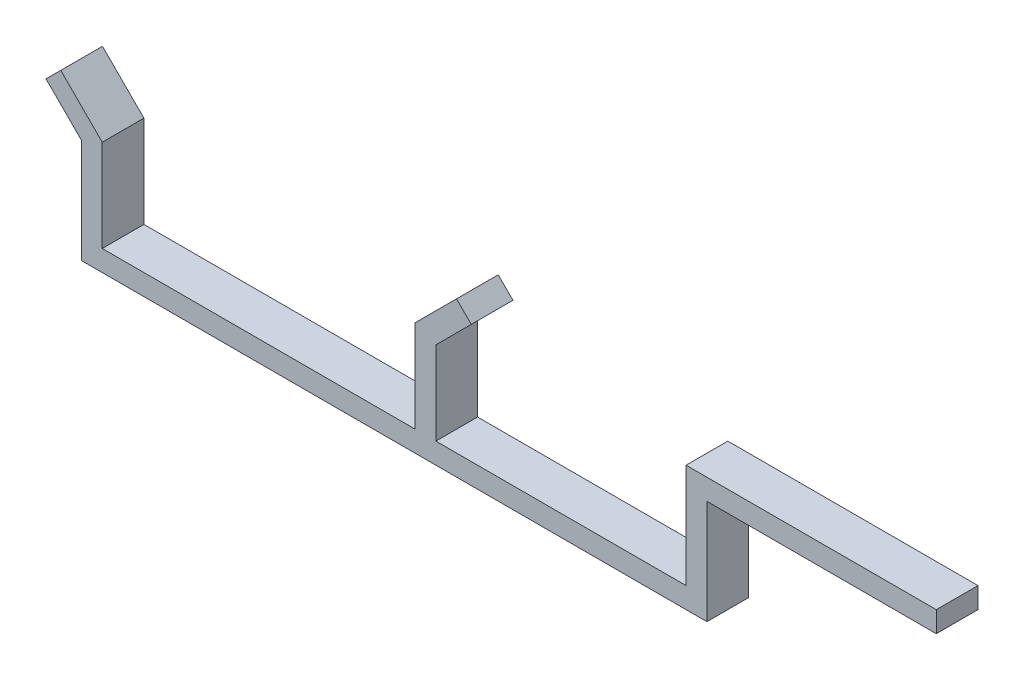
ISO-10303-21;
HEADER;
FILE_DESCRIPTION(('STEP AP214'),'2;1');
FILE_NAME('part.step','',(''),(''),'','','');
FILE_SCHEMA(('AUTOMOTIVE_DESIGN { 1 0 10303 214 1 1 1 1 }'));
ENDSEC;
DATA;
#1=APPLICATION_CONTEXT('core data for automotive mechanical design processes');
#2=APPLICATION_PROTOCOL_DEFINITION('international standard','automotive_design',2000,#1);
#3=PRODUCT_CONTEXT('',#1,'mechanical');
#4=PRODUCT('Part','Part','',(#3));
#5=PRODUCT_RELATED_PRODUCT_CATEGORY('part','',(#4));
#6=PRODUCT_DEFINITION_FORMATION('','',#4);
#7=PRODUCT_DEFINITION_CONTEXT('part definition',#1,'design');
#8=PRODUCT_DEFINITION('design','',#6,#7);
#9=PRODUCT_DEFINITION_SHAPE('','',#8);
#10=(LENGTH_UNIT() NAMED_UNIT(*) SI_UNIT(.MILLI.,.METRE.));
#11=(NAMED_UNIT(*) PLANE_ANGLE_UNIT() SI_UNIT($,.RADIAN.));
#12=(NAMED_UNIT(*) SI_UNIT($,.STERADIAN.) SOLID_ANGLE_UNIT());
#13=UNCERTAINTY_MEASURE_WITH_UNIT(LENGTH_MEASURE(1.E-05),#10,'distance_accuracy_value','');
#14=(GEOMETRIC_REPRESENTATION_CONTEXT(3) GLOBAL_UNCERTAINTY_ASSIGNED_CONTEXT((#13)) GLOBAL_UNIT_ASSIGNED_CONTEXT((#10,
#11,#12)) REPRESENTATION_CONTEXT('',''));
#15=CARTESIAN_POINT('',(0.,0.,0.));
#16=DIRECTION('',(0.,0.,1.));
#17=DIRECTION('',(1.,0.,0.));
#18=AXIS2_PLACEMENT_3D('',#15,#16,#17);
#19=CARTESIAN_POINT('',(-42.5000000000001,8.63523936170218,10.));
#20=DIRECTION('',(0.707106781186547,0.707106781186548,0.));
#21=DIRECTION('',(-0.707106781186548,0.707106781186547,0.));
#22=AXIS2_PLACEMENT_3D('',#19,#20,#21);
#23=PLANE('',#22);
#24=DIRECTION('',(0.707106781186548,-0.707106781186547,0.));
#25=VECTOR('',#24,1.);
#26=CARTESIAN_POINT('',(-42.5,8.63523936170218,0.));
#27=LINE('',#26,#25);
#28=CARTESIAN_POINT('',(-50.9852813742386,17.1205207359407,0.));
#29=VERTEX_POINT('',#28);
#30=CARTESIAN_POINT('',(-42.5,8.63523936170218,0.));
#31=VERTEX_POINT('',#30);
#32=EDGE_CURVE('E197',#29,#31,#27,.T.);
#33=ORIENTED_EDGE('',*,*,#32,.T.);
#34=DIRECTION('',(0.,0.,-1.));
#35=VECTOR('',#34,1.);
#36=CARTESIAN_POINT('',(-42.5000000000001,8.63523936170218,10.));
#37=LINE('',#36,#35);
#38=CARTESIAN_POINT('',(-42.5000000000001,8.63523936170218,10.));
#39=VERTEX_POINT('',#38);
#40=EDGE_CURVE('E11',#39,#31,#37,.T.);
#41=ORIENTED_EDGE('',*,*,#40,.F.);
#42=DIRECTION('',(0.707106781186548,-0.707106781186547,0.));
#43=VECTOR('',#42,1.);
#44=CARTESIAN_POINT('',(-42.5000000000001,8.63523936170218,10.));
#45=LINE('',#44,#43);
#46=CARTESIAN_POINT('',(-50.9852813742387,17.1205207359407,10.));
#47=VERTEX_POINT('',#46);
#48=EDGE_CURVE('E251',#47,#39,#45,.T.);
#49=ORIENTED_EDGE('',*,*,#48,.F.);
#50=DIRECTION('',(0.,0.,-1.));
#51=VECTOR('',#50,1.);
#52=CARTESIAN_POINT('',(-50.9852813742387,17.1205207359407,10.));
#53=LINE('',#52,#51);
#54=EDGE_CURVE('E193',#47,#29,#53,.T.);
#55=ORIENTED_EDGE('',*,*,#54,.T.);
#56=EDGE_LOOP('',(#33,#41,#49,#55));
#57=FACE_BOUND('',#56,.T.);
#58=ADVANCED_FACE('F36',(#57),#23,.F.);
#59=CARTESIAN_POINT('',(-42.5000000000001,8.63523936170218,10.));
#60=DIRECTION('',(1.,0.,0.));
#61=DIRECTION('',(0.,1.,0.));
#62=AXIS2_PLACEMENT_3D('',#59,#60,#61);
#63=PLANE('',#62);
#64=DIRECTION('',(0.,-1.,0.));
#65=VECTOR('',#64,1.);
#66=CARTESIAN_POINT('',(-42.5,8.63523936170218,0.));
#67=LINE('',#66,#65);
#68=CARTESIAN_POINT('',(-42.5,-16.3647606382978,0.));
#69=VERTEX_POINT('',#68);
#70=EDGE_CURVE('E201',#31,#69,#67,.T.);
#71=ORIENTED_EDGE('',*,*,#70,.T.);
#72=DIRECTION('',(0.,0.,-1.));
#73=VECTOR('',#72,1.);
#74=CARTESIAN_POINT('',(-42.5000000000001,-16.3647606382978,10.));
#75=LINE('',#74,#73);
#76=CARTESIAN_POINT('',(-42.5000000000001,-16.3647606382978,10.));
#77=VERTEX_POINT('',#76);
#78=EDGE_CURVE('E45',#77,#69,#75,.T.);
#79=ORIENTED_EDGE('',*,*,#78,.F.);
#80=DIRECTION('',(0.,-1.,0.));
#81=VECTOR('',#80,1.);
#82=CARTESIAN_POINT('',(-42.5000000000001,8.63523936170218,10.));
#83=LINE('',#82,#81);
#84=EDGE_CURVE('E126',#39,#77,#83,.T.);
#85=ORIENTED_EDGE('',*,*,#84,.F.);
#86=ORIENTED_EDGE('',*,*,#40,.T.);
#87=EDGE_LOOP('',(#71,#79,#85,#86));
#88=FACE_BOUND('',#87,.T.);
#89=ADVANCED_FACE('F400',(#88),#63,.F.);
#90=CARTESIAN_POINT('',(-42.5000000000001,-16.3647606382978,10.));
#91=DIRECTION('',(0.,1.,0.));
#92=DIRECTION('',(0.,0.,1.));
#93=AXIS2_PLACEMENT_3D('',#90,#91,#92);
#94=PLANE('',#93);
#95=DIRECTION('',(1.,0.,0.));
#96=VECTOR('',#95,1.);
#97=CARTESIAN_POINT('',(-42.5,-16.3647606382978,0.));
#98=LINE('',#97,#96);
#99=CARTESIAN_POINT('',(107.5,-16.3647606382978,0.));
#100=VERTEX_POINT('',#99);
#101=EDGE_CURVE('E204',#69,#100,#98,.T.);
#102=ORIENTED_EDGE('',*,*,#101,.T.);
#103=DIRECTION('',(0.,0.,-1.));
#104=VECTOR('',#103,1.);
#105=CARTESIAN_POINT('',(107.5,-16.3647606382978,10.));
#106=LINE('',#105,#104);
#107=CARTESIAN_POINT('',(107.5,-16.3647606382978,10.));
#108=VERTEX_POINT('',#107);
#109=EDGE_CURVE('E302',#108,#100,#106,.T.);
#110=ORIENTED_EDGE('',*,*,#109,.F.);
#111=DIRECTION('',(1.,0.,0.));
#112=VECTOR('',#111,1.);
#113=CARTESIAN_POINT('',(-42.5000000000001,-16.3647606382978,10.));
#114=LINE('',#113,#112);
#115=EDGE_CURVE('E313',#77,#108,#114,.T.);
#116=ORIENTED_EDGE('',*,*,#115,.F.);
#117=ORIENTED_EDGE('',*,*,#78,.T.);
#118=EDGE_LOOP('',(#102,#110,#116,#117));
#119=FACE_BOUND('',#118,.T.);
#120=ADVANCED_FACE('F311',(#119),#94,.F.);
#121=CARTESIAN_POINT('',(107.5,8.63523936170218,10.));
#122=DIRECTION('',(-1.,0.,0.));
#123=DIRECTION('',(0.,-1.,0.));
#124=AXIS2_PLACEMENT_3D('',#121,#122,#123);
#125=PLANE('',#124);
#126=DIRECTION('',(0.,1.,0.));
#127=VECTOR('',#126,1.);
#128=CARTESIAN_POINT('',(107.5,8.63523936170218,0.));
#129=LINE('',#128,#127);
#130=CARTESIAN_POINT('',(107.5,8.63523936170218,0.));
#131=VERTEX_POINT('',#130);
#132=EDGE_CURVE('E207',#100,#131,#129,.T.);
#133=ORIENTED_EDGE('',*,*,#132,.T.);
#134=DIRECTION('',(0.,0.,-1.));
#135=VECTOR('',#134,1.);
#136=CARTESIAN_POINT('',(107.5,8.63523936170218,10.));
#137=LINE('',#136,#135);
#138=CARTESIAN_POINT('',(107.5,8.63523936170218,10.));
#139=VERTEX_POINT('',#138);
#140=EDGE_CURVE('E298',#139,#131,#137,.T.);
#141=ORIENTED_EDGE('',*,*,#140,.F.);
#142=DIRECTION('',(0.,1.,0.));
#143=VECTOR('',#142,1.);
#144=CARTESIAN_POINT('',(107.5,8.63523936170218,10.));
#145=LINE('',#144,#143);
#146=EDGE_CURVE('E332',#108,#139,#145,.T.);
#147=ORIENTED_EDGE('',*,*,#146,.F.);
#148=ORIENTED_EDGE('',*,*,#109,.T.);
#149=EDGE_LOOP('',(#133,#141,#147,#148));
#150=FACE_BOUND('',#149,.T.);
#151=ADVANCED_FACE('F322',(#150),#125,.F.);
#152=CARTESIAN_POINT('',(162.5,8.63523936170218,10.0000000000005));
#153=DIRECTION('',(0.,1.,0.));
#154=DIRECTION('',(-1.,0.,0.));
#155=AXIS2_PLACEMENT_3D('',#152,#153,#154);
#156=PLANE('',#155);
#157=DIRECTION('',(1.,0.,0.));
#158=VECTOR('',#157,1.);
#159=CARTESIAN_POINT('',(162.5,8.63523936170218,6.66133814775094E-13));
#160=LINE('',#159,#158);
#161=CARTESIAN_POINT('',(162.5,8.63523936170218,6.66133814775094E-13));
#162=VERTEX_POINT('',#161);
#163=EDGE_CURVE('E210',#131,#162,#160,.T.);
#164=ORIENTED_EDGE('',*,*,#163,.T.);
#165=DIRECTION('',(0.,0.,-1.));
#166=VECTOR('',#165,1.);
#167=CARTESIAN_POINT('',(162.5,8.63523936170218,10.0000000000005));
#168=LINE('',#167,#166);
#169=CARTESIAN_POINT('',(162.5,8.63523936170218,10.0000000000005));
#170=VERTEX_POINT('',#169);
#171=EDGE_CURVE('E294',#170,#162,#168,.T.);
#172=ORIENTED_EDGE('',*,*,#171,.F.);
#173=DIRECTION('',(1.,0.,0.));
#174=VECTOR('',#173,1.);
#175=CARTESIAN_POINT('',(162.5,8.63523936170218,10.0000000000005));
#176=LINE('',#175,#174);
#177=EDGE_CURVE('E328',#139,#170,#176,.T.);
#178=ORIENTED_EDGE('',*,*,#177,.F.);
#179=ORIENTED_EDGE('',*,*,#140,.T.);
#180=EDGE_LOOP('',(#164,#172,#178,#179));
#181=FACE_BOUND('',#180,.T.);
#182=ADVANCED_FACE('F326',(#181),#156,.F.);
#183=CARTESIAN_POINT('',(162.5,13.6352393617022,10.0000000000005));
#184=DIRECTION('',(-1.,0.,0.));
#185=DIRECTION('',(0.,-1.,0.));
#186=AXIS2_PLACEMENT_3D('',#183,#184,#185);
#187=PLANE('',#186);
#188=DIRECTION('',(0.,1.,0.));
#189=VECTOR('',#188,1.);
#190=CARTESIAN_POINT('',(162.5,13.6352393617022,6.66133814775094E-13));
#191=LINE('',#190,#189);
#192=CARTESIAN_POINT('',(162.5,13.6352393617022,6.66133814775094E-13));
#193=VERTEX_POINT('',#192);
#194=EDGE_CURVE('E213',#162,#193,#191,.T.);
#195=ORIENTED_EDGE('',*,*,#194,.T.);
#196=DIRECTION('',(0.,0.,-1.));
#197=VECTOR('',#196,1.);
#198=CARTESIAN_POINT('',(162.5,13.6352393617022,10.0000000000005));
#199=LINE('',#198,#197);
#200=CARTESIAN_POINT('',(162.5,13.6352393617022,10.0000000000005));
#201=VERTEX_POINT('',#200);
#202=EDGE_CURVE('E290',#201,#193,#199,.T.);
#203=ORIENTED_EDGE('',*,*,#202,.F.);
#204=DIRECTION('',(0.,1.,0.));
#205=VECTOR('',#204,1.);
#206=CARTESIAN_POINT('',(162.5,13.6352393617022,10.0000000000005));
#207=LINE('',#206,#205);
#208=EDGE_CURVE('E331',#170,#201,#207,.T.);
#209=ORIENTED_EDGE('',*,*,#208,.F.);
#210=ORIENTED_EDGE('',*,*,#171,.T.);
#211=EDGE_LOOP('',(#195,#203,#209,#210));
#212=FACE_BOUND('',#211,.T.);
#213=ADVANCED_FACE('F413',(#212),#187,.F.);
#214=CARTESIAN_POINT('',(102.5,13.6352393617022,10.));
#215=DIRECTION('',(0.,-1.,0.));
#216=DIRECTION('',(0.,0.,-1.));
#217=AXIS2_PLACEMENT_3D('',#214,#215,#216);
#218=PLANE('',#217);
#219=DIRECTION('',(-1.,0.,0.));
#220=VECTOR('',#219,1.);
#221=CARTESIAN_POINT('',(102.5,13.6352393617022,0.));
#222=LINE('',#221,#220);
#223=CARTESIAN_POINT('',(102.5,13.6352393617022,0.));
#224=VERTEX_POINT('',#223);
#225=EDGE_CURVE('E216',#193,#224,#222,.T.);
#226=ORIENTED_EDGE('',*,*,#225,.T.);
#227=DIRECTION('',(0.,0.,-1.));
#228=VECTOR('',#227,1.);
#229=CARTESIAN_POINT('',(102.5,13.6352393617022,10.));
#230=LINE('',#229,#228);
#231=CARTESIAN_POINT('',(102.5,13.6352393617022,10.));
#232=VERTEX_POINT('',#231);
#233=EDGE_CURVE('E286',#232,#224,#230,.T.);
#234=ORIENTED_EDGE('',*,*,#233,.F.);
#235=DIRECTION('',(-1.,0.,0.));
#236=VECTOR('',#235,1.);
#237=CARTESIAN_POINT('',(102.5,13.6352393617022,10.));
#238=LINE('',#237,#236);
#239=EDGE_CURVE('E337',#201,#232,#238,.T.);
#240=ORIENTED_EDGE('',*,*,#239,.F.);
#241=ORIENTED_EDGE('',*,*,#202,.T.);
#242=EDGE_LOOP('',(#226,#234,#240,#241));
#243=FACE_BOUND('',#242,.T.);
#244=ADVANCED_FACE('F416',(#243),#218,.F.);
#245=CARTESIAN_POINT('',(102.5,-11.3647606382978,10.));
#246=DIRECTION('',(1.,0.,0.));
#247=DIRECTION('',(0.,1.,0.));
#248=AXIS2_PLACEMENT_3D('',#245,#246,#247);
#249=PLANE('',#248);
#250=DIRECTION('',(0.,-1.,0.));
#251=VECTOR('',#250,1.);
#252=CARTESIAN_POINT('',(102.5,-11.3647606382978,0.));
#253=LINE('',#252,#251);
#254=CARTESIAN_POINT('',(102.5,-11.3647606382978,0.));
#255=VERTEX_POINT('',#254);
#256=EDGE_CURVE('E219',#224,#255,#253,.T.);
#257=ORIENTED_EDGE('',*,*,#256,.T.);
#258=DIRECTION('',(0.,0.,-1.));
#259=VECTOR('',#258,1.);
#260=CARTESIAN_POINT('',(102.5,-11.3647606382978,10.));
#261=LINE('',#260,#259);
#262=CARTESIAN_POINT('',(102.5,-11.3647606382978,10.));
#263=VERTEX_POINT('',#262);
#264=EDGE_CURVE('E282',#263,#255,#261,.T.);
#265=ORIENTED_EDGE('',*,*,#264,.F.);
#266=DIRECTION('',(0.,-1.,0.));
#267=VECTOR('',#266,1.);
#268=CARTESIAN_POINT('',(102.5,-11.3647606382978,10.));
#269=LINE('',#268,#267);
#270=EDGE_CURVE('E344',#232,#263,#269,.T.);
#271=ORIENTED_EDGE('',*,*,#270,.F.);
#272=ORIENTED_EDGE('',*,*,#233,.T.);
#273=EDGE_LOOP('',(#257,#265,#271,#272));
#274=FACE_BOUND('',#273,.T.);
#275=ADVANCED_FACE('F420',(#274),#249,.F.);
#276=CARTESIAN_POINT('',(42.5,-11.3647606382978,10.0000000000001));
#277=DIRECTION('',(0.,-1.,0.));
#278=DIRECTION('',(1.,0.,0.));
#279=AXIS2_PLACEMENT_3D('',#276,#277,#278);
#280=PLANE('',#279);
#281=DIRECTION('',(-1.,0.,0.));
#282=VECTOR('',#281,1.);
#283=CARTESIAN_POINT('',(42.5000000000001,-11.3647606382978,1.11022302462516E-13));
#284=LINE('',#283,#282);
#285=CARTESIAN_POINT('',(42.5000000000001,-11.3647606382978,1.11022302462516E-13));
#286=VERTEX_POINT('',#285);
#287=EDGE_CURVE('E222',#255,#286,#284,.T.);
#288=ORIENTED_EDGE('',*,*,#287,.T.);
#289=DIRECTION('',(0.,0.,-1.));
#290=VECTOR('',#289,1.);
#291=CARTESIAN_POINT('',(42.5,-11.3647606382978,10.0000000000001));
#292=LINE('',#291,#290);
#293=CARTESIAN_POINT('',(42.5,-11.3647606382978,10.0000000000001));
#294=VERTEX_POINT('',#293);
#295=EDGE_CURVE('E278',#294,#286,#292,.T.);
#296=ORIENTED_EDGE('',*,*,#295,.F.);
#297=DIRECTION('',(-1.,0.,0.));
#298=VECTOR('',#297,1.);
#299=CARTESIAN_POINT('',(42.5,-11.3647606382978,10.0000000000001));
#300=LINE('',#299,#298);
#301=EDGE_CURVE('E347',#263,#294,#300,.T.);
#302=ORIENTED_EDGE('',*,*,#301,.F.);
#303=ORIENTED_EDGE('',*,*,#264,.T.);
#304=EDGE_LOOP('',(#288,#296,#302,#303));
#305=FACE_BOUND('',#304,.T.);
#306=ADVANCED_FACE('F424',(#305),#280,.F.);
#307=CARTESIAN_POINT('',(42.5,-11.3647606382978,10.0000000000001));
#308=DIRECTION('',(-1.,0.,0.));
#309=DIRECTION('',(0.,-1.,0.));
#310=AXIS2_PLACEMENT_3D('',#307,#308,#309);
#311=PLANE('',#310);
#312=DIRECTION('',(0.,1.,0.));
#313=VECTOR('',#312,1.);
#314=CARTESIAN_POINT('',(42.5000000000001,-11.3647606382978,1.11022302462516E-13));
#315=LINE('',#314,#313);
#316=CARTESIAN_POINT('',(42.5000000000001,8.63523936170218,1.11022302462516E-13));
#317=VERTEX_POINT('',#316);
#318=EDGE_CURVE('E225',#286,#317,#315,.T.);
#319=ORIENTED_EDGE('',*,*,#318,.T.);
#320=DIRECTION('',(0.,0.,-1.));
#321=VECTOR('',#320,1.);
#322=CARTESIAN_POINT('',(42.5,8.63523936170218,10.0000000000001));
#323=LINE('',#322,#321);
#324=CARTESIAN_POINT('',(42.5,8.63523936170218,10.0000000000001));
#325=VERTEX_POINT('',#324);
#326=EDGE_CURVE('E274',#325,#317,#323,.T.);
#327=ORIENTED_EDGE('',*,*,#326,.F.);
#328=DIRECTION('',(0.,1.,0.));
#329=VECTOR('',#328,1.);
#330=CARTESIAN_POINT('',(42.5,-11.3647606382978,10.0000000000001));
#331=LINE('',#330,#329);
#332=EDGE_CURVE('E350',#294,#325,#331,.T.);
#333=ORIENTED_EDGE('',*,*,#332,.F.);
#334=ORIENTED_EDGE('',*,*,#295,.T.);
#335=EDGE_LOOP('',(#319,#327,#333,#334));
#336=FACE_BOUND('',#335,.T.);
#337=ADVANCED_FACE('F428',(#336),#311,.F.);
#338=CARTESIAN_POINT('',(42.5,8.63523936170218,10.0000000000001));
#339=DIRECTION('',(-0.707106781186548,0.707106781186547,0.));
#340=DIRECTION('',(-0.707106781186547,-0.707106781186548,0.));
#341=AXIS2_PLACEMENT_3D('',#338,#339,#340);
#342=PLANE('',#341);
#343=DIRECTION('',(0.707106781186547,0.707106781186548,0.));
#344=VECTOR('',#343,1.);
#345=CARTESIAN_POINT('',(42.5000000000001,8.63523936170218,1.11022302462516E-13));
#346=LINE('',#345,#344);
#347=CARTESIAN_POINT('',(50.9852813742387,17.1205207359407,3.33066907387547E-13));
#348=VERTEX_POINT('',#347);
#349=EDGE_CURVE('E228',#317,#348,#346,.T.);
#350=ORIENTED_EDGE('',*,*,#349,.T.);
#351=DIRECTION('',(0.,0.,-1.));
#352=VECTOR('',#351,1.);
#353=CARTESIAN_POINT('',(50.9852813742385,17.1205207359407,10.0000000000003));
#354=LINE('',#353,#352);
#355=CARTESIAN_POINT('',(50.9852813742385,17.1205207359407,10.0000000000003));
#356=VERTEX_POINT('',#355);
#357=EDGE_CURVE('E270',#356,#348,#354,.T.);
#358=ORIENTED_EDGE('',*,*,#357,.F.);
#359=DIRECTION('',(0.707106781186547,0.707106781186548,0.));
#360=VECTOR('',#359,1.);
#361=CARTESIAN_POINT('',(42.5,8.63523936170218,10.0000000000001));
#362=LINE('',#361,#360);
#363=EDGE_CURVE('E353',#325,#356,#362,.T.);
#364=ORIENTED_EDGE('',*,*,#363,.F.);
#365=ORIENTED_EDGE('',*,*,#326,.T.);
#366=EDGE_LOOP('',(#350,#358,#364,#365));
#367=FACE_BOUND('',#366,.T.);
#368=ADVANCED_FACE('F432',(#367),#342,.F.);
#369=CARTESIAN_POINT('',(50.9852813742385,17.1205207359407,10.0000000000003));
#370=DIRECTION('',(-0.707106781186548,-0.707106781186548,0.));
#371=DIRECTION('',(0.707106781186548,-0.707106781186548,0.));
#372=AXIS2_PLACEMENT_3D('',#369,#370,#371);
#373=PLANE('',#372);
#374=DIRECTION('',(-0.707106781186548,0.707106781186548,0.));
#375=VECTOR('',#374,1.);
#376=CARTESIAN_POINT('',(50.9852813742387,17.1205207359407,3.33066907387547E-13));
#377=LINE('',#376,#375);
#378=CARTESIAN_POINT('',(47.449747468306,20.6560546418735,6.66133814775094E-13));
#379=VERTEX_POINT('',#378);
#380=EDGE_CURVE('E231',#348,#379,#377,.T.);
#381=ORIENTED_EDGE('',*,*,#380,.T.);
#382=DIRECTION('',(0.,0.,-1.));
#383=VECTOR('',#382,1.);
#384=CARTESIAN_POINT('',(47.4497474683058,20.6560546418735,10.0000000000007));
#385=LINE('',#384,#383);
#386=CARTESIAN_POINT('',(47.4497474683058,20.6560546418735,10.0000000000007));
#387=VERTEX_POINT('',#386);
#388=EDGE_CURVE('E266',#387,#379,#385,.T.);
#389=ORIENTED_EDGE('',*,*,#388,.F.);
#390=DIRECTION('',(-0.707106781186548,0.707106781186548,0.));
#391=VECTOR('',#390,1.);
#392=CARTESIAN_POINT('',(50.9852813742385,17.1205207359407,10.0000000000003));
#393=LINE('',#392,#391);
#394=EDGE_CURVE('E356',#356,#387,#393,.T.);
#395=ORIENTED_EDGE('',*,*,#394,.F.);
#396=ORIENTED_EDGE('',*,*,#357,.T.);
#397=EDGE_LOOP('',(#381,#389,#395,#396));
#398=FACE_BOUND('',#397,.T.);
#399=ADVANCED_FACE('F436',(#398),#373,.F.);
#400=CARTESIAN_POINT('',(37.5,10.7063071735676,10.));
#401=DIRECTION('',(0.707106781186548,-0.707106781186547,0.));
#402=DIRECTION('',(0.707106781186547,0.707106781186548,0.));
#403=AXIS2_PLACEMENT_3D('',#400,#401,#402);
#404=PLANE('',#403);
#405=DIRECTION('',(-0.707106781186547,-0.707106781186548,0.));
#406=VECTOR('',#405,1.);
#407=CARTESIAN_POINT('',(37.5000000000001,10.7063071735676,2.22044604925031E-13));
#408=LINE('',#407,#406);
#409=CARTESIAN_POINT('',(37.5000000000001,10.7063071735676,2.22044604925031E-13));
#410=VERTEX_POINT('',#409);
#411=EDGE_CURVE('E234',#379,#410,#408,.T.);
#412=ORIENTED_EDGE('',*,*,#411,.T.);
#413=DIRECTION('',(0.,0.,-1.));
#414=VECTOR('',#413,1.);
#415=CARTESIAN_POINT('',(37.5,10.7063071735676,10.));
#416=LINE('',#415,#414);
#417=CARTESIAN_POINT('',(37.5,10.7063071735676,10.));
#418=VERTEX_POINT('',#417);
#419=EDGE_CURVE('E262',#418,#410,#416,.T.);
#420=ORIENTED_EDGE('',*,*,#419,.F.);
#421=DIRECTION('',(-0.707106781186547,-0.707106781186548,0.));
#422=VECTOR('',#421,1.);
#423=CARTESIAN_POINT('',(37.5,10.7063071735676,10.));
#424=LINE('',#423,#422);
#425=EDGE_CURVE('E359',#387,#418,#424,.T.);
#426=ORIENTED_EDGE('',*,*,#425,.F.);
#427=ORIENTED_EDGE('',*,*,#388,.T.);
#428=EDGE_LOOP('',(#412,#420,#426,#427));
#429=FACE_BOUND('',#428,.T.);
#430=ADVANCED_FACE('F440',(#429),#404,.F.);
#431=CARTESIAN_POINT('',(37.5,-11.3647606382978,10.));
#432=DIRECTION('',(1.,0.,0.));
#433=DIRECTION('',(0.,1.,0.));
#434=AXIS2_PLACEMENT_3D('',#431,#432,#433);
#435=PLANE('',#434);
#436=DIRECTION('',(0.,-1.,0.));
#437=VECTOR('',#436,1.);
#438=CARTESIAN_POINT('',(37.5000000000001,-11.3647606382978,2.22044604925031E-13));
#439=LINE('',#438,#437);
#440=CARTESIAN_POINT('',(37.5000000000001,-11.3647606382978,2.22044604925031E-13));
#441=VERTEX_POINT('',#440);
#442=EDGE_CURVE('E238',#410,#441,#439,.T.);
#443=ORIENTED_EDGE('',*,*,#442,.T.);
#444=DIRECTION('',(0.,0.,-1.));
#445=VECTOR('',#444,1.);
#446=CARTESIAN_POINT('',(37.5,-11.3647606382978,10.));
#447=LINE('',#446,#445);
#448=CARTESIAN_POINT('',(37.5,-11.3647606382978,10.));
#449=VERTEX_POINT('',#448);
#450=EDGE_CURVE('E258',#449,#441,#447,.T.);
#451=ORIENTED_EDGE('',*,*,#450,.F.);
#452=DIRECTION('',(0.,-1.,0.));
#453=VECTOR('',#452,1.);
#454=CARTESIAN_POINT('',(37.5,8.63523936170218,10.));
#455=LINE('',#454,#453);
#456=EDGE_CURVE('E362',#418,#449,#455,.T.);
#457=ORIENTED_EDGE('',*,*,#456,.F.);
#458=ORIENTED_EDGE('',*,*,#419,.T.);
#459=EDGE_LOOP('',(#443,#451,#457,#458));
#460=FACE_BOUND('',#459,.T.);
#461=ADVANCED_FACE('F381',(#460),#435,.F.);
#462=CARTESIAN_POINT('',(-37.5000000000001,-11.3647606382978,10.0000000000003));
#463=DIRECTION('',(0.,-1.,0.));
#464=DIRECTION('',(0.,0.,-1.));
#465=AXIS2_PLACEMENT_3D('',#462,#463,#464);
#466=PLANE('',#465);
#467=DIRECTION('',(-1.,0.,0.));
#468=VECTOR('',#467,1.);
#469=CARTESIAN_POINT('',(-37.5,-11.3647606382978,3.33066907387547E-13));
#470=LINE('',#469,#468);
#471=CARTESIAN_POINT('',(-37.5,-11.3647606382978,3.33066907387547E-13));
#472=VERTEX_POINT('',#471);
#473=EDGE_CURVE('E241',#441,#472,#470,.T.);
#474=ORIENTED_EDGE('',*,*,#473,.T.);
#475=DIRECTION('',(0.,0.,-1.));
#476=VECTOR('',#475,1.);
#477=CARTESIAN_POINT('',(-37.5000000000001,-11.3647606382978,10.0000000000003));
#478=LINE('',#477,#476);
#479=CARTESIAN_POINT('',(-37.5000000000001,-11.3647606382978,10.0000000000003));
#480=VERTEX_POINT('',#479);
#481=EDGE_CURVE('E185',#480,#472,#478,.T.);
#482=ORIENTED_EDGE('',*,*,#481,.F.);
#483=DIRECTION('',(-1.,0.,0.));
#484=VECTOR('',#483,1.);
#485=CARTESIAN_POINT('',(-37.5000000000001,-11.3647606382978,10.0000000000003));
#486=LINE('',#485,#484);
#487=EDGE_CURVE('E175',#449,#480,#486,.T.);
#488=ORIENTED_EDGE('',*,*,#487,.F.);
#489=ORIENTED_EDGE('',*,*,#450,.T.);
#490=EDGE_LOOP('',(#474,#482,#488,#489));
#491=FACE_BOUND('',#490,.T.);
#492=ADVANCED_FACE('F384',(#491),#466,.F.);
#493=CARTESIAN_POINT('',(-37.5000000000001,8.63523936170218,10.0000000000003));
#494=DIRECTION('',(-1.,0.,0.));
#495=DIRECTION('',(0.,0.,1.));
#496=AXIS2_PLACEMENT_3D('',#493,#494,#495);
#497=PLANE('',#496);
#498=DIRECTION('',(0.,1.,0.));
#499=VECTOR('',#498,1.);
#500=CARTESIAN_POINT('',(-37.5,8.63523936170218,3.33066907387547E-13));
#501=LINE('',#500,#499);
#502=CARTESIAN_POINT('',(-37.5,10.7063071735676,3.33066907387547E-13));
#503=VERTEX_POINT('',#502);
#504=EDGE_CURVE('E183',#472,#503,#501,.T.);
#505=ORIENTED_EDGE('',*,*,#504,.T.);
#506=DIRECTION('',(0.,0.,-1.));
#507=VECTOR('',#506,1.);
#508=CARTESIAN_POINT('',(-37.5000000000001,10.7063071735676,10.0000000000003));
#509=LINE('',#508,#507);
#510=CARTESIAN_POINT('',(-37.5000000000001,10.7063071735676,10.0000000000003));
#511=VERTEX_POINT('',#510);
#512=EDGE_CURVE('E181',#511,#503,#509,.T.);
#513=ORIENTED_EDGE('',*,*,#512,.F.);
#514=DIRECTION('',(0.,1.,0.));
#515=VECTOR('',#514,1.);
#516=CARTESIAN_POINT('',(-37.5000000000001,8.63523936170218,10.0000000000003));
#517=LINE('',#516,#515);
#518=EDGE_CURVE('E169',#480,#511,#517,.T.);
#519=ORIENTED_EDGE('',*,*,#518,.F.);
#520=ORIENTED_EDGE('',*,*,#481,.T.);
#521=EDGE_LOOP('',(#505,#513,#519,#520));
#522=FACE_BOUND('',#521,.T.);
#523=ADVANCED_FACE('F182',(#522),#497,.F.);
#524=CARTESIAN_POINT('',(-37.5000000000001,10.7063071735676,10.0000000000003));
#525=DIRECTION('',(-0.707106781186548,-0.707106781186547,0.));
#526=DIRECTION('',(0.707106781186547,-0.707106781186548,0.));
#527=AXIS2_PLACEMENT_3D('',#524,#525,#526);
#528=PLANE('',#527);
#529=DIRECTION('',(-0.707106781186547,0.707106781186548,0.));
#530=VECTOR('',#529,1.);
#531=CARTESIAN_POINT('',(-37.5,10.7063071735676,3.33066907387547E-13));
#532=LINE('',#531,#530);
#533=CARTESIAN_POINT('',(-47.4497474683059,20.6560546418735,0.));
#534=VERTEX_POINT('',#533);
#535=EDGE_CURVE('E112',#503,#534,#532,.T.);
#536=ORIENTED_EDGE('',*,*,#535,.T.);
#537=DIRECTION('',(0.,0.,-1.));
#538=VECTOR('',#537,1.);
#539=CARTESIAN_POINT('',(-47.449747468306,20.6560546418735,10.));
#540=LINE('',#539,#538);
#541=CARTESIAN_POINT('',(-47.449747468306,20.6560546418735,10.));
#542=VERTEX_POINT('',#541);
#543=EDGE_CURVE('E186',#542,#534,#540,.T.);
#544=ORIENTED_EDGE('',*,*,#543,.F.);
#545=DIRECTION('',(-0.707106781186547,0.707106781186548,0.));
#546=VECTOR('',#545,1.);
#547=CARTESIAN_POINT('',(-37.5000000000001,10.7063071735676,10.0000000000003));
#548=LINE('',#547,#546);
#549=EDGE_CURVE('E173',#511,#542,#548,.T.);
#550=ORIENTED_EDGE('',*,*,#549,.F.);
#551=ORIENTED_EDGE('',*,*,#512,.T.);
#552=EDGE_LOOP('',(#536,#544,#550,#551));
#553=FACE_BOUND('',#552,.T.);
#554=ADVANCED_FACE('F188',(#553),#528,.F.);
#555=CARTESIAN_POINT('',(-50.9852813742387,17.1205207359407,10.));
#556=DIRECTION('',(0.707106781186548,-0.707106781186547,0.));
#557=DIRECTION('',(0.707106781186547,0.707106781186548,0.));
#558=AXIS2_PLACEMENT_3D('',#555,#556,#557);
#559=PLANE('',#558);
#560=DIRECTION('',(-0.707106781186547,-0.707106781186548,0.));
#561=VECTOR('',#560,1.);
#562=CARTESIAN_POINT('',(-50.9852813742386,17.1205207359407,0.));
#563=LINE('',#562,#561);
#564=EDGE_CURVE('E118',#534,#29,#563,.T.);
#565=ORIENTED_EDGE('',*,*,#564,.T.);
#566=ORIENTED_EDGE('',*,*,#54,.F.);
#567=DIRECTION('',(-0.707106781186547,-0.707106781186548,0.));
#568=VECTOR('',#567,1.);
#569=CARTESIAN_POINT('',(-50.9852813742387,17.1205207359407,10.));
#570=LINE('',#569,#568);
#571=EDGE_CURVE('E53',#542,#47,#570,.T.);
#572=ORIENTED_EDGE('',*,*,#571,.F.);
#573=ORIENTED_EDGE('',*,*,#543,.T.);
#574=EDGE_LOOP('',(#565,#566,#572,#573));
#575=FACE_BOUND('',#574,.T.);
#576=ADVANCED_FACE('F389',(#575),#559,.F.);
#577=CARTESIAN_POINT('',(-1.11022302462516E-13,0.,10.));
#578=DIRECTION('',(0.,0.,-1.));
#579=DIRECTION('',(-1.,0.,0.));
#580=AXIS2_PLACEMENT_3D('',#577,#578,#579);
#581=PLANE('',#580);
#582=ORIENTED_EDGE('',*,*,#48,.T.);
#583=ORIENTED_EDGE('',*,*,#84,.T.);
#584=ORIENTED_EDGE('',*,*,#115,.T.);
#585=ORIENTED_EDGE('',*,*,#146,.T.);
#586=ORIENTED_EDGE('',*,*,#177,.T.);
#587=ORIENTED_EDGE('',*,*,#208,.T.);
#588=ORIENTED_EDGE('',*,*,#239,.T.);
#589=ORIENTED_EDGE('',*,*,#270,.T.);
#590=ORIENTED_EDGE('',*,*,#301,.T.);
#591=ORIENTED_EDGE('',*,*,#332,.T.);
#592=ORIENTED_EDGE('',*,*,#363,.T.);
#593=ORIENTED_EDGE('',*,*,#394,.T.);
#594=ORIENTED_EDGE('',*,*,#425,.T.);
#595=ORIENTED_EDGE('',*,*,#456,.T.);
#596=ORIENTED_EDGE('',*,*,#487,.T.);
#597=ORIENTED_EDGE('',*,*,#518,.T.);
#598=ORIENTED_EDGE('',*,*,#549,.T.);
#599=ORIENTED_EDGE('',*,*,#571,.T.);
#600=EDGE_LOOP('',(#582,#583,#584,#585,#586,#587,#588,#589,#590,#591,#592,#593,#594,#595,#596,
#597,#598,#599));
#601=FACE_BOUND('',#600,.T.);
#602=ADVANCED_FACE('F171',(#601),#581,.F.);
#603=CARTESIAN_POINT('',(0.,0.,0.));
#604=DIRECTION('',(0.,0.,-1.));
#605=DIRECTION('',(-1.,0.,0.));
#606=AXIS2_PLACEMENT_3D('',#603,#604,#605);
#607=PLANE('',#606);
#608=ORIENTED_EDGE('',*,*,#32,.F.);
#609=ORIENTED_EDGE('',*,*,#564,.F.);
#610=ORIENTED_EDGE('',*,*,#535,.F.);
#611=ORIENTED_EDGE('',*,*,#504,.F.);
#612=ORIENTED_EDGE('',*,*,#473,.F.);
#613=ORIENTED_EDGE('',*,*,#442,.F.);
#614=ORIENTED_EDGE('',*,*,#411,.F.);
#615=ORIENTED_EDGE('',*,*,#380,.F.);
#616=ORIENTED_EDGE('',*,*,#349,.F.);
#617=ORIENTED_EDGE('',*,*,#318,.F.);
#618=ORIENTED_EDGE('',*,*,#287,.F.);
#619=ORIENTED_EDGE('',*,*,#256,.F.);
#620=ORIENTED_EDGE('',*,*,#225,.F.);
#621=ORIENTED_EDGE('',*,*,#194,.F.);
#622=ORIENTED_EDGE('',*,*,#163,.F.);
#623=ORIENTED_EDGE('',*,*,#132,.F.);
#624=ORIENTED_EDGE('',*,*,#101,.F.);
#625=ORIENTED_EDGE('',*,*,#70,.F.);
#626=EDGE_LOOP('',(#608,#609,#610,#611,#612,#613,#614,#615,#616,#617,#618,#619,#620,#621,#622,
#623,#624,#625));
#627=FACE_BOUND('',#626,.T.);
#628=ADVANCED_FACE('F317',(#627),#607,.T.);
#629=CLOSED_SHELL('',(#58,#89,#120,#151,#182,#213,#244,#275,#306,#337,#368,#399,#430,#461,#492,
#523,#554,#576,#602,#628));
#630=MANIFOLD_SOLID_BREP('B2',#629);
#631=ADVANCED_BREP_SHAPE_REPRESENTATION('',(#18,#630),#14);
#632=SHAPE_DEFINITION_REPRESENTATION(#9,#631);
ENDSEC;
END-ISO-10303-21;
